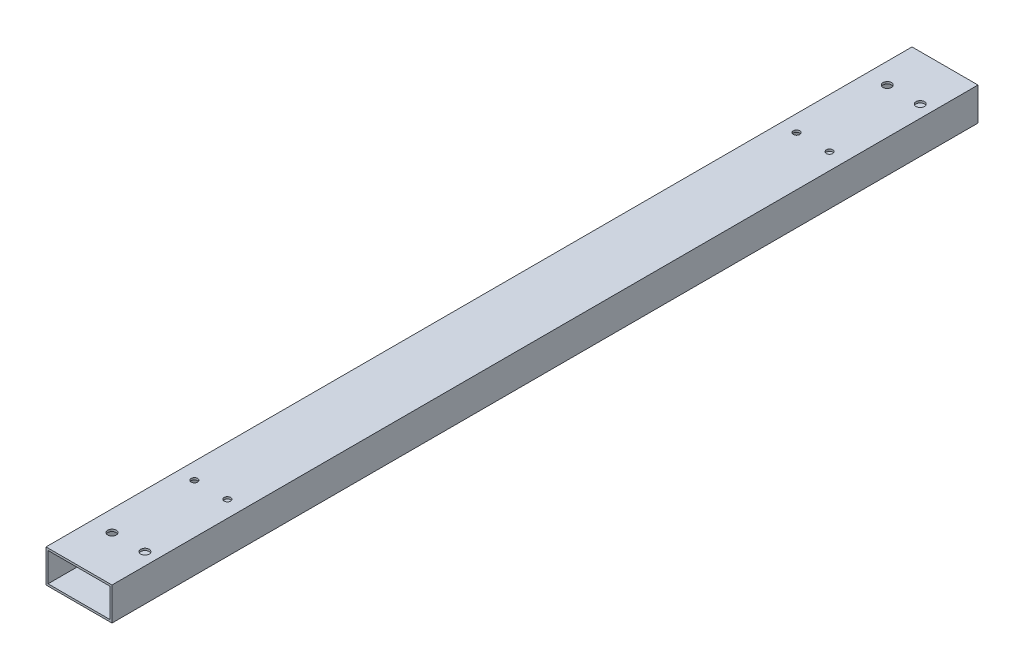
ISO-10303-21;
HEADER;
FILE_DESCRIPTION(('STEP AP214'),'2;1');
FILE_NAME('part.step','',(''),(''),'','','');
FILE_SCHEMA(('AUTOMOTIVE_DESIGN { 1 0 10303 214 1 1 1 1 }'));
ENDSEC;
DATA;
#1=APPLICATION_CONTEXT('core data for automotive mechanical design processes');
#2=APPLICATION_PROTOCOL_DEFINITION('international standard','automotive_design',2000,#1);
#3=PRODUCT_CONTEXT('',#1,'mechanical');
#4=PRODUCT('Part','Part','',(#3));
#5=PRODUCT_RELATED_PRODUCT_CATEGORY('part','',(#4));
#6=PRODUCT_DEFINITION_FORMATION('','',#4);
#7=PRODUCT_DEFINITION_CONTEXT('part definition',#1,'design');
#8=PRODUCT_DEFINITION('design','',#6,#7);
#9=PRODUCT_DEFINITION_SHAPE('','',#8);
#10=(LENGTH_UNIT() NAMED_UNIT(*) SI_UNIT(.MILLI.,.METRE.));
#11=(NAMED_UNIT(*) PLANE_ANGLE_UNIT() SI_UNIT($,.RADIAN.));
#12=(NAMED_UNIT(*) SI_UNIT($,.STERADIAN.) SOLID_ANGLE_UNIT());
#13=UNCERTAINTY_MEASURE_WITH_UNIT(LENGTH_MEASURE(1.E-05),#10,'distance_accuracy_value','');
#14=(GEOMETRIC_REPRESENTATION_CONTEXT(3) GLOBAL_UNCERTAINTY_ASSIGNED_CONTEXT((#13)) GLOBAL_UNIT_ASSIGNED_CONTEXT((#10,
#11,#12)) REPRESENTATION_CONTEXT('',''));
#15=CARTESIAN_POINT('',(0.,0.,0.));
#16=DIRECTION('',(0.,0.,1.));
#17=DIRECTION('',(1.,0.,0.));
#18=AXIS2_PLACEMENT_3D('',#15,#16,#17);
#19=CARTESIAN_POINT('',(38.1,13.3600000001,101.6));
#20=DIRECTION('',(0.,1.,0.));
#21=DIRECTION('',(0.,0.,1.));
#22=AXIS2_PLACEMENT_3D('',#19,#20,#21);
#23=CYLINDRICAL_SURFACE('',#22,4.7625);
#24=CARTESIAN_POINT('',(38.1,0.,101.6));
#25=DIRECTION('',(0.,1.,0.));
#26=DIRECTION('',(0.,0.,1.));
#27=AXIS2_PLACEMENT_3D('',#24,#25,#26);
#28=CIRCLE('',#27,4.7625);
#29=CARTESIAN_POINT('',(38.1,0.,106.3625));
#30=VERTEX_POINT('',#29);
#31=EDGE_CURVE('E20',#30,#30,#28,.T.);
#32=ORIENTED_EDGE('',*,*,#31,.F.);
#33=EDGE_LOOP('',(#32));
#34=FACE_BOUND('',#33,.T.);
#35=CARTESIAN_POINT('',(38.1,1.5875,101.6));
#36=DIRECTION('',(0.,1.,0.));
#37=DIRECTION('',(0.,0.,1.));
#38=AXIS2_PLACEMENT_3D('',#35,#36,#37);
#39=CIRCLE('',#38,4.7625);
#40=CARTESIAN_POINT('',(38.1,1.5875,106.3625));
#41=VERTEX_POINT('',#40);
#42=EDGE_CURVE('E121',#41,#41,#39,.T.);
#43=ORIENTED_EDGE('',*,*,#42,.T.);
#44=EDGE_LOOP('',(#43));
#45=FACE_BOUND('',#44,.T.);
#46=ADVANCED_FACE('F17',(#34,#45),#23,.F.);
#47=CARTESIAN_POINT('',(12.7,13.3600000001,101.6));
#48=DIRECTION('',(0.,1.,0.));
#49=DIRECTION('',(0.,0.,1.));
#50=AXIS2_PLACEMENT_3D('',#47,#48,#49);
#51=CYLINDRICAL_SURFACE('',#50,4.7625);
#52=CARTESIAN_POINT('',(12.7,0.,101.6));
#53=DIRECTION('',(0.,1.,0.));
#54=DIRECTION('',(0.,0.,1.));
#55=AXIS2_PLACEMENT_3D('',#52,#53,#54);
#56=CIRCLE('',#55,4.7625);
#57=CARTESIAN_POINT('',(12.7,0.,106.3625));
#58=VERTEX_POINT('',#57);
#59=EDGE_CURVE('E209',#58,#58,#56,.T.);
#60=ORIENTED_EDGE('',*,*,#59,.F.);
#61=EDGE_LOOP('',(#60));
#62=FACE_BOUND('',#61,.T.);
#63=CARTESIAN_POINT('',(12.7,1.5875,101.6));
#64=DIRECTION('',(0.,1.,0.));
#65=DIRECTION('',(0.,0.,1.));
#66=AXIS2_PLACEMENT_3D('',#63,#64,#65);
#67=CIRCLE('',#66,4.7625);
#68=CARTESIAN_POINT('',(12.7,1.5875,106.3625));
#69=VERTEX_POINT('',#68);
#70=EDGE_CURVE('E188',#69,#69,#67,.T.);
#71=ORIENTED_EDGE('',*,*,#70,.T.);
#72=EDGE_LOOP('',(#71));
#73=FACE_BOUND('',#72,.T.);
#74=ADVANCED_FACE('F221',(#62,#73),#51,.F.);
#75=CARTESIAN_POINT('',(38.1,13.3600000001,565.15));
#76=DIRECTION('',(0.,1.,0.));
#77=DIRECTION('',(0.,0.,1.));
#78=AXIS2_PLACEMENT_3D('',#75,#76,#77);
#79=CYLINDRICAL_SURFACE('',#78,4.7625);
#80=CARTESIAN_POINT('',(38.1,0.,565.15));
#81=DIRECTION('',(0.,1.,0.));
#82=DIRECTION('',(0.,0.,1.));
#83=AXIS2_PLACEMENT_3D('',#80,#81,#82);
#84=CIRCLE('',#83,4.7625);
#85=CARTESIAN_POINT('',(38.1,0.,569.9125));
#86=VERTEX_POINT('',#85);
#87=EDGE_CURVE('E207',#86,#86,#84,.T.);
#88=ORIENTED_EDGE('',*,*,#87,.F.);
#89=EDGE_LOOP('',(#88));
#90=FACE_BOUND('',#89,.T.);
#91=CARTESIAN_POINT('',(38.1,1.5875,565.15));
#92=DIRECTION('',(0.,1.,0.));
#93=DIRECTION('',(0.,0.,1.));
#94=AXIS2_PLACEMENT_3D('',#91,#92,#93);
#95=CIRCLE('',#94,4.7625);
#96=CARTESIAN_POINT('',(38.1,1.5875,569.9125));
#97=VERTEX_POINT('',#96);
#98=EDGE_CURVE('E185',#97,#97,#95,.T.);
#99=ORIENTED_EDGE('',*,*,#98,.T.);
#100=EDGE_LOOP('',(#99));
#101=FACE_BOUND('',#100,.T.);
#102=ADVANCED_FACE('F365',(#90,#101),#79,.F.);
#103=CARTESIAN_POINT('',(12.7,13.3600000001,565.15));
#104=DIRECTION('',(0.,1.,0.));
#105=DIRECTION('',(0.,0.,1.));
#106=AXIS2_PLACEMENT_3D('',#103,#104,#105);
#107=CYLINDRICAL_SURFACE('',#106,4.7625);
#108=CARTESIAN_POINT('',(12.7,0.,565.15));
#109=DIRECTION('',(0.,1.,0.));
#110=DIRECTION('',(0.,0.,1.));
#111=AXIS2_PLACEMENT_3D('',#108,#109,#110);
#112=CIRCLE('',#111,4.7625);
#113=CARTESIAN_POINT('',(12.7,0.,569.9125));
#114=VERTEX_POINT('',#113);
#115=EDGE_CURVE('E204',#114,#114,#112,.T.);
#116=ORIENTED_EDGE('',*,*,#115,.F.);
#117=EDGE_LOOP('',(#116));
#118=FACE_BOUND('',#117,.T.);
#119=CARTESIAN_POINT('',(12.7,1.5875,565.15));
#120=DIRECTION('',(0.,1.,0.));
#121=DIRECTION('',(0.,0.,1.));
#122=AXIS2_PLACEMENT_3D('',#119,#120,#121);
#123=CIRCLE('',#122,4.7625);
#124=CARTESIAN_POINT('',(12.7,1.5875,569.9125));
#125=VERTEX_POINT('',#124);
#126=EDGE_CURVE('E182',#125,#125,#123,.T.);
#127=ORIENTED_EDGE('',*,*,#126,.T.);
#128=EDGE_LOOP('',(#127));
#129=FACE_BOUND('',#128,.T.);
#130=ADVANCED_FACE('F361',(#118,#129),#107,.F.);
#131=CARTESIAN_POINT('',(15.875,13.3600000001,631.825));
#132=DIRECTION('',(0.,1.,0.));
#133=DIRECTION('',(0.,0.,1.));
#134=AXIS2_PLACEMENT_3D('',#131,#132,#133);
#135=CYLINDRICAL_SURFACE('',#134,3.2639);
#136=CARTESIAN_POINT('',(15.875,0.,631.825));
#137=DIRECTION('',(0.,1.,0.));
#138=DIRECTION('',(0.,0.,1.));
#139=AXIS2_PLACEMENT_3D('',#136,#137,#138);
#140=CIRCLE('',#139,3.2639);
#141=CARTESIAN_POINT('',(15.875,0.,635.0889));
#142=VERTEX_POINT('',#141);
#143=EDGE_CURVE('E201',#142,#142,#140,.T.);
#144=ORIENTED_EDGE('',*,*,#143,.F.);
#145=EDGE_LOOP('',(#144));
#146=FACE_BOUND('',#145,.T.);
#147=CARTESIAN_POINT('',(15.875,1.5875,631.825));
#148=DIRECTION('',(0.,1.,0.));
#149=DIRECTION('',(0.,0.,1.));
#150=AXIS2_PLACEMENT_3D('',#147,#148,#149);
#151=CIRCLE('',#150,3.2639);
#152=CARTESIAN_POINT('',(15.875,1.5875,635.0889));
#153=VERTEX_POINT('',#152);
#154=EDGE_CURVE('E179',#153,#153,#151,.T.);
#155=ORIENTED_EDGE('',*,*,#154,.T.);
#156=EDGE_LOOP('',(#155));
#157=FACE_BOUND('',#156,.T.);
#158=ADVANCED_FACE('F357',(#146,#157),#135,.F.);
#159=CARTESIAN_POINT('',(41.275,13.3600000001,631.825));
#160=DIRECTION('',(0.,1.,0.));
#161=DIRECTION('',(0.,0.,1.));
#162=AXIS2_PLACEMENT_3D('',#159,#160,#161);
#163=CYLINDRICAL_SURFACE('',#162,3.2639);
#164=CARTESIAN_POINT('',(41.275,0.,631.825));
#165=DIRECTION('',(0.,1.,0.));
#166=DIRECTION('',(0.,0.,1.));
#167=AXIS2_PLACEMENT_3D('',#164,#165,#166);
#168=CIRCLE('',#167,3.2639);
#169=CARTESIAN_POINT('',(41.275,0.,635.0889));
#170=VERTEX_POINT('',#169);
#171=EDGE_CURVE('E198',#170,#170,#168,.T.);
#172=ORIENTED_EDGE('',*,*,#171,.F.);
#173=EDGE_LOOP('',(#172));
#174=FACE_BOUND('',#173,.T.);
#175=CARTESIAN_POINT('',(41.275,1.5875,631.825));
#176=DIRECTION('',(0.,1.,0.));
#177=DIRECTION('',(0.,0.,1.));
#178=AXIS2_PLACEMENT_3D('',#175,#176,#177);
#179=CIRCLE('',#178,3.2639);
#180=CARTESIAN_POINT('',(41.275,1.5875,635.0889));
#181=VERTEX_POINT('',#180);
#182=EDGE_CURVE('E176',#181,#181,#179,.T.);
#183=ORIENTED_EDGE('',*,*,#182,.T.);
#184=EDGE_LOOP('',(#183));
#185=FACE_BOUND('',#184,.T.);
#186=ADVANCED_FACE('F353',(#174,#185),#163,.F.);
#187=CARTESIAN_POINT('',(41.275,13.3600000001,34.925));
#188=DIRECTION('',(0.,1.,0.));
#189=DIRECTION('',(0.,0.,1.));
#190=AXIS2_PLACEMENT_3D('',#187,#188,#189);
#191=CYLINDRICAL_SURFACE('',#190,3.2639);
#192=CARTESIAN_POINT('',(41.275,0.,34.925));
#193=DIRECTION('',(0.,1.,0.));
#194=DIRECTION('',(0.,0.,1.));
#195=AXIS2_PLACEMENT_3D('',#192,#193,#194);
#196=CIRCLE('',#195,3.2639);
#197=CARTESIAN_POINT('',(41.275,0.,38.1889));
#198=VERTEX_POINT('',#197);
#199=EDGE_CURVE('E195',#198,#198,#196,.T.);
#200=ORIENTED_EDGE('',*,*,#199,.F.);
#201=EDGE_LOOP('',(#200));
#202=FACE_BOUND('',#201,.T.);
#203=CARTESIAN_POINT('',(41.275,1.5875,34.925));
#204=DIRECTION('',(0.,1.,0.));
#205=DIRECTION('',(0.,0.,1.));
#206=AXIS2_PLACEMENT_3D('',#203,#204,#205);
#207=CIRCLE('',#206,3.2639);
#208=CARTESIAN_POINT('',(41.275,1.5875,38.1889));
#209=VERTEX_POINT('',#208);
#210=EDGE_CURVE('E173',#209,#209,#207,.T.);
#211=ORIENTED_EDGE('',*,*,#210,.T.);
#212=EDGE_LOOP('',(#211));
#213=FACE_BOUND('',#212,.T.);
#214=ADVANCED_FACE('F349',(#202,#213),#191,.F.);
#215=CARTESIAN_POINT('',(15.875,13.3600000001,34.925));
#216=DIRECTION('',(0.,1.,0.));
#217=DIRECTION('',(0.,0.,1.));
#218=AXIS2_PLACEMENT_3D('',#215,#216,#217);
#219=CYLINDRICAL_SURFACE('',#218,3.2639);
#220=CARTESIAN_POINT('',(15.875,0.,34.925));
#221=DIRECTION('',(0.,1.,0.));
#222=DIRECTION('',(0.,0.,1.));
#223=AXIS2_PLACEMENT_3D('',#220,#221,#222);
#224=CIRCLE('',#223,3.2639);
#225=CARTESIAN_POINT('',(15.875,0.,38.1889));
#226=VERTEX_POINT('',#225);
#227=EDGE_CURVE('E122',#226,#226,#224,.T.);
#228=ORIENTED_EDGE('',*,*,#227,.F.);
#229=EDGE_LOOP('',(#228));
#230=FACE_BOUND('',#229,.T.);
#231=CARTESIAN_POINT('',(15.875,1.5875,34.925));
#232=DIRECTION('',(0.,1.,0.));
#233=DIRECTION('',(0.,0.,1.));
#234=AXIS2_PLACEMENT_3D('',#231,#232,#233);
#235=CIRCLE('',#234,3.2639);
#236=CARTESIAN_POINT('',(15.875,1.5875,38.1889));
#237=VERTEX_POINT('',#236);
#238=EDGE_CURVE('E119',#237,#237,#235,.T.);
#239=ORIENTED_EDGE('',*,*,#238,.T.);
#240=EDGE_LOOP('',(#239));
#241=FACE_BOUND('',#240,.T.);
#242=ADVANCED_FACE('F345',(#230,#241),#219,.F.);
#243=CARTESIAN_POINT('',(0.,0.,0.));
#244=DIRECTION('',(0.,-1.,0.));
#245=DIRECTION('',(0.,0.,-1.));
#246=AXIS2_PLACEMENT_3D('',#243,#244,#245);
#247=PLANE('',#246);
#248=ORIENTED_EDGE('',*,*,#227,.T.);
#249=EDGE_LOOP('',(#248));
#250=FACE_BOUND('',#249,.T.);
#251=ORIENTED_EDGE('',*,*,#199,.T.);
#252=EDGE_LOOP('',(#251));
#253=FACE_BOUND('',#252,.T.);
#254=ORIENTED_EDGE('',*,*,#171,.T.);
#255=EDGE_LOOP('',(#254));
#256=FACE_BOUND('',#255,.T.);
#257=ORIENTED_EDGE('',*,*,#143,.T.);
#258=EDGE_LOOP('',(#257));
#259=FACE_BOUND('',#258,.T.);
#260=ORIENTED_EDGE('',*,*,#115,.T.);
#261=EDGE_LOOP('',(#260));
#262=FACE_BOUND('',#261,.T.);
#263=ORIENTED_EDGE('',*,*,#87,.T.);
#264=EDGE_LOOP('',(#263));
#265=FACE_BOUND('',#264,.T.);
#266=ORIENTED_EDGE('',*,*,#59,.T.);
#267=EDGE_LOOP('',(#266));
#268=FACE_BOUND('',#267,.T.);
#269=ORIENTED_EDGE('',*,*,#31,.T.);
#270=EDGE_LOOP('',(#269));
#271=FACE_BOUND('',#270,.T.);
#272=DIRECTION('',(0.,0.,-1.));
#273=VECTOR('',#272,1.);
#274=CARTESIAN_POINT('',(50.8,0.,0.));
#275=LINE('',#274,#273);
#276=CARTESIAN_POINT('',(50.8,0.,666.75));
#277=VERTEX_POINT('',#276);
#278=CARTESIAN_POINT('',(50.8,0.,0.));
#279=VERTEX_POINT('',#278);
#280=EDGE_CURVE('E114',#277,#279,#275,.T.);
#281=ORIENTED_EDGE('',*,*,#280,.F.);
#282=DIRECTION('',(1.,0.,0.));
#283=VECTOR('',#282,1.);
#284=CARTESIAN_POINT('',(0.,0.,666.75));
#285=LINE('',#284,#283);
#286=CARTESIAN_POINT('',(0.,0.,666.75));
#287=VERTEX_POINT('',#286);
#288=EDGE_CURVE('E249',#287,#277,#285,.T.);
#289=ORIENTED_EDGE('',*,*,#288,.F.);
#290=DIRECTION('',(0.,0.,1.));
#291=VECTOR('',#290,1.);
#292=CARTESIAN_POINT('',(0.,0.,0.));
#293=LINE('',#292,#291);
#294=CARTESIAN_POINT('',(0.,0.,0.));
#295=VERTEX_POINT('',#294);
#296=EDGE_CURVE('E252',#295,#287,#293,.T.);
#297=ORIENTED_EDGE('',*,*,#296,.F.);
#298=DIRECTION('',(1.,0.,0.));
#299=VECTOR('',#298,1.);
#300=CARTESIAN_POINT('',(0.,0.,0.));
#301=LINE('',#300,#299);
#302=EDGE_CURVE('E111',#295,#279,#301,.T.);
#303=ORIENTED_EDGE('',*,*,#302,.T.);
#304=EDGE_LOOP('',(#281,#289,#297,#303));
#305=FACE_BOUND('',#304,.T.);
#306=ADVANCED_FACE('F216',(#250,#253,#256,#259,#262,#265,#268,#271,#305),#247,.T.);
#307=CARTESIAN_POINT('',(49.2125,1.5875,0.));
#308=DIRECTION('',(1.,0.,0.));
#309=DIRECTION('',(0.,0.,-1.));
#310=AXIS2_PLACEMENT_3D('',#307,#308,#309);
#311=PLANE('',#310);
#312=DIRECTION('',(0.,0.,1.));
#313=VECTOR('',#312,1.);
#314=CARTESIAN_POINT('',(49.2125,23.8125,0.));
#315=LINE('',#314,#313);
#316=CARTESIAN_POINT('',(49.2125,23.8125,666.75));
#317=VERTEX_POINT('',#316);
#318=CARTESIAN_POINT('',(49.2125,23.8125,0.));
#319=VERTEX_POINT('',#318);
#320=EDGE_CURVE('E79',#317,#319,#315,.F.);
#321=ORIENTED_EDGE('',*,*,#320,.T.);
#322=DIRECTION('',(0.,1.,0.));
#323=VECTOR('',#322,1.);
#324=CARTESIAN_POINT('',(49.2125,0.,0.));
#325=LINE('',#324,#323);
#326=CARTESIAN_POINT('',(49.2125,1.5875,0.));
#327=VERTEX_POINT('',#326);
#328=EDGE_CURVE('E83',#319,#327,#325,.F.);
#329=ORIENTED_EDGE('',*,*,#328,.T.);
#330=DIRECTION('',(0.,0.,-1.));
#331=VECTOR('',#330,1.);
#332=CARTESIAN_POINT('',(49.2125,1.5875,0.));
#333=LINE('',#332,#331);
#334=CARTESIAN_POINT('',(49.2125,1.5875,666.75));
#335=VERTEX_POINT('',#334);
#336=EDGE_CURVE('E120',#327,#335,#333,.F.);
#337=ORIENTED_EDGE('',*,*,#336,.T.);
#338=DIRECTION('',(0.,1.,0.));
#339=VECTOR('',#338,1.);
#340=CARTESIAN_POINT('',(49.2125,0.,666.75));
#341=LINE('',#340,#339);
#342=EDGE_CURVE('E86',#317,#335,#341,.F.);
#343=ORIENTED_EDGE('',*,*,#342,.F.);
#344=EDGE_LOOP('',(#321,#329,#337,#343));
#345=FACE_BOUND('',#344,.T.);
#346=ADVANCED_FACE('F81',(#345),#311,.F.);
#347=CARTESIAN_POINT('',(1.5875,1.5875,0.));
#348=DIRECTION('',(0.,-1.,0.));
#349=DIRECTION('',(0.,0.,-1.));
#350=AXIS2_PLACEMENT_3D('',#347,#348,#349);
#351=PLANE('',#350);
#352=ORIENTED_EDGE('',*,*,#238,.F.);
#353=EDGE_LOOP('',(#352));
#354=FACE_BOUND('',#353,.T.);
#355=ORIENTED_EDGE('',*,*,#210,.F.);
#356=EDGE_LOOP('',(#355));
#357=FACE_BOUND('',#356,.T.);
#358=ORIENTED_EDGE('',*,*,#182,.F.);
#359=EDGE_LOOP('',(#358));
#360=FACE_BOUND('',#359,.T.);
#361=ORIENTED_EDGE('',*,*,#154,.F.);
#362=EDGE_LOOP('',(#361));
#363=FACE_BOUND('',#362,.T.);
#364=ORIENTED_EDGE('',*,*,#126,.F.);
#365=EDGE_LOOP('',(#364));
#366=FACE_BOUND('',#365,.T.);
#367=ORIENTED_EDGE('',*,*,#98,.F.);
#368=EDGE_LOOP('',(#367));
#369=FACE_BOUND('',#368,.T.);
#370=ORIENTED_EDGE('',*,*,#70,.F.);
#371=EDGE_LOOP('',(#370));
#372=FACE_BOUND('',#371,.T.);
#373=ORIENTED_EDGE('',*,*,#42,.F.);
#374=EDGE_LOOP('',(#373));
#375=FACE_BOUND('',#374,.T.);
#376=ORIENTED_EDGE('',*,*,#336,.F.);
#377=DIRECTION('',(1.,0.,0.));
#378=VECTOR('',#377,1.);
#379=CARTESIAN_POINT('',(0.,1.5875,0.));
#380=LINE('',#379,#378);
#381=CARTESIAN_POINT('',(1.5875,1.5875,0.));
#382=VERTEX_POINT('',#381);
#383=EDGE_CURVE('E104',#327,#382,#380,.F.);
#384=ORIENTED_EDGE('',*,*,#383,.T.);
#385=DIRECTION('',(0.,0.,1.));
#386=VECTOR('',#385,1.);
#387=CARTESIAN_POINT('',(1.5875,1.5875,0.));
#388=LINE('',#387,#386);
#389=CARTESIAN_POINT('',(1.5875,1.5875,666.75));
#390=VERTEX_POINT('',#389);
#391=EDGE_CURVE('E91',#382,#390,#388,.T.);
#392=ORIENTED_EDGE('',*,*,#391,.T.);
#393=DIRECTION('',(1.,0.,0.));
#394=VECTOR('',#393,1.);
#395=CARTESIAN_POINT('',(0.,1.5875,666.75));
#396=LINE('',#395,#394);
#397=EDGE_CURVE('E233',#335,#390,#396,.F.);
#398=ORIENTED_EDGE('',*,*,#397,.F.);
#399=EDGE_LOOP('',(#376,#384,#392,#398));
#400=FACE_BOUND('',#399,.T.);
#401=ADVANCED_FACE('F224',(#354,#357,#360,#363,#366,#369,#372,#375,#400),#351,.F.);
#402=CARTESIAN_POINT('',(1.5875,23.8125,0.));
#403=DIRECTION('',(-1.,0.,0.));
#404=DIRECTION('',(0.,0.,1.));
#405=AXIS2_PLACEMENT_3D('',#402,#403,#404);
#406=PLANE('',#405);
#407=ORIENTED_EDGE('',*,*,#391,.F.);
#408=DIRECTION('',(0.,1.,0.));
#409=VECTOR('',#408,1.);
#410=CARTESIAN_POINT('',(1.5875,0.,0.));
#411=LINE('',#410,#409);
#412=CARTESIAN_POINT('',(1.5875,23.8125,0.));
#413=VERTEX_POINT('',#412);
#414=EDGE_CURVE('E106',#382,#413,#411,.T.);
#415=ORIENTED_EDGE('',*,*,#414,.T.);
#416=DIRECTION('',(0.,0.,1.));
#417=VECTOR('',#416,1.);
#418=CARTESIAN_POINT('',(1.5875,23.8125,0.));
#419=LINE('',#418,#417);
#420=CARTESIAN_POINT('',(1.5875,23.8125,666.75));
#421=VERTEX_POINT('',#420);
#422=EDGE_CURVE('E90',#413,#421,#419,.T.);
#423=ORIENTED_EDGE('',*,*,#422,.T.);
#424=DIRECTION('',(0.,1.,0.));
#425=VECTOR('',#424,1.);
#426=CARTESIAN_POINT('',(1.5875,0.,666.75));
#427=LINE('',#426,#425);
#428=EDGE_CURVE('E170',#390,#421,#427,.T.);
#429=ORIENTED_EDGE('',*,*,#428,.F.);
#430=EDGE_LOOP('',(#407,#415,#423,#429));
#431=FACE_BOUND('',#430,.T.);
#432=ADVANCED_FACE('F227',(#431),#406,.F.);
#433=CARTESIAN_POINT('',(49.2125,23.8125,0.));
#434=DIRECTION('',(0.,1.,0.));
#435=DIRECTION('',(0.,0.,1.));
#436=AXIS2_PLACEMENT_3D('',#433,#434,#435);
#437=PLANE('',#436);
#438=CARTESIAN_POINT('',(15.875,23.8125,34.925));
#439=DIRECTION('',(0.,1.,0.));
#440=DIRECTION('',(0.,0.,1.));
#441=AXIS2_PLACEMENT_3D('',#438,#439,#440);
#442=CIRCLE('',#441,3.2639);
#443=CARTESIAN_POINT('',(15.875,23.8125,38.1889));
#444=VERTEX_POINT('',#443);
#445=EDGE_CURVE('E145',#444,#444,#442,.T.);
#446=ORIENTED_EDGE('',*,*,#445,.T.);
#447=EDGE_LOOP('',(#446));
#448=FACE_BOUND('',#447,.T.);
#449=CARTESIAN_POINT('',(41.275,23.8125,34.925));
#450=DIRECTION('',(0.,1.,0.));
#451=DIRECTION('',(0.,0.,1.));
#452=AXIS2_PLACEMENT_3D('',#449,#450,#451);
#453=CIRCLE('',#452,3.2639);
#454=CARTESIAN_POINT('',(41.275,23.8125,38.1889));
#455=VERTEX_POINT('',#454);
#456=EDGE_CURVE('E149',#455,#455,#453,.T.);
#457=ORIENTED_EDGE('',*,*,#456,.T.);
#458=EDGE_LOOP('',(#457));
#459=FACE_BOUND('',#458,.T.);
#460=CARTESIAN_POINT('',(41.275,23.8125,631.825));
#461=DIRECTION('',(0.,1.,0.));
#462=DIRECTION('',(0.,0.,1.));
#463=AXIS2_PLACEMENT_3D('',#460,#461,#462);
#464=CIRCLE('',#463,3.2639);
#465=CARTESIAN_POINT('',(41.275,23.8125,635.0889));
#466=VERTEX_POINT('',#465);
#467=EDGE_CURVE('E152',#466,#466,#464,.T.);
#468=ORIENTED_EDGE('',*,*,#467,.T.);
#469=EDGE_LOOP('',(#468));
#470=FACE_BOUND('',#469,.T.);
#471=CARTESIAN_POINT('',(15.875,23.8125,631.825));
#472=DIRECTION('',(0.,1.,0.));
#473=DIRECTION('',(0.,0.,1.));
#474=AXIS2_PLACEMENT_3D('',#471,#472,#473);
#475=CIRCLE('',#474,3.2639);
#476=CARTESIAN_POINT('',(15.875,23.8125,635.0889));
#477=VERTEX_POINT('',#476);
#478=EDGE_CURVE('E155',#477,#477,#475,.T.);
#479=ORIENTED_EDGE('',*,*,#478,.T.);
#480=EDGE_LOOP('',(#479));
#481=FACE_BOUND('',#480,.T.);
#482=CARTESIAN_POINT('',(12.7,23.8125,565.15));
#483=DIRECTION('',(0.,-1.,0.));
#484=DIRECTION('',(0.,0.,-1.));
#485=AXIS2_PLACEMENT_3D('',#482,#483,#484);
#486=CIRCLE('',#485,2.4892);
#487=CARTESIAN_POINT('',(12.7,23.8125,562.6608));
#488=VERTEX_POINT('',#487);
#489=EDGE_CURVE('E158',#488,#488,#486,.F.);
#490=ORIENTED_EDGE('',*,*,#489,.T.);
#491=EDGE_LOOP('',(#490));
#492=FACE_BOUND('',#491,.T.);
#493=CARTESIAN_POINT('',(38.1,23.8125,565.15));
#494=DIRECTION('',(0.,-1.,0.));
#495=DIRECTION('',(0.,0.,-1.));
#496=AXIS2_PLACEMENT_3D('',#493,#494,#495);
#497=CIRCLE('',#496,2.4892);
#498=CARTESIAN_POINT('',(38.1,23.8125,562.6608));
#499=VERTEX_POINT('',#498);
#500=EDGE_CURVE('E161',#499,#499,#497,.F.);
#501=ORIENTED_EDGE('',*,*,#500,.T.);
#502=EDGE_LOOP('',(#501));
#503=FACE_BOUND('',#502,.T.);
#504=CARTESIAN_POINT('',(12.7,23.8125,101.6));
#505=DIRECTION('',(0.,-1.,0.));
#506=DIRECTION('',(0.,0.,-1.));
#507=AXIS2_PLACEMENT_3D('',#504,#505,#506);
#508=CIRCLE('',#507,2.4892);
#509=CARTESIAN_POINT('',(12.7,23.8125,99.1108));
#510=VERTEX_POINT('',#509);
#511=EDGE_CURVE('E164',#510,#510,#508,.F.);
#512=ORIENTED_EDGE('',*,*,#511,.T.);
#513=EDGE_LOOP('',(#512));
#514=FACE_BOUND('',#513,.T.);
#515=CARTESIAN_POINT('',(38.1,23.8125,101.6));
#516=DIRECTION('',(0.,-1.,0.));
#517=DIRECTION('',(0.,0.,-1.));
#518=AXIS2_PLACEMENT_3D('',#515,#516,#517);
#519=CIRCLE('',#518,2.4892);
#520=CARTESIAN_POINT('',(38.1,23.8125,99.1108));
#521=VERTEX_POINT('',#520);
#522=EDGE_CURVE('E167',#521,#521,#519,.F.);
#523=ORIENTED_EDGE('',*,*,#522,.T.);
#524=EDGE_LOOP('',(#523));
#525=FACE_BOUND('',#524,.T.);
#526=ORIENTED_EDGE('',*,*,#422,.F.);
#527=DIRECTION('',(1.,0.,0.));
#528=VECTOR('',#527,1.);
#529=CARTESIAN_POINT('',(0.,23.8125,0.));
#530=LINE('',#529,#528);
#531=EDGE_CURVE('E94',#413,#319,#530,.T.);
#532=ORIENTED_EDGE('',*,*,#531,.T.);
#533=ORIENTED_EDGE('',*,*,#320,.F.);
#534=DIRECTION('',(1.,0.,0.));
#535=VECTOR('',#534,1.);
#536=CARTESIAN_POINT('',(0.,23.8125,666.75));
#537=LINE('',#536,#535);
#538=EDGE_CURVE('E240',#421,#317,#537,.T.);
#539=ORIENTED_EDGE('',*,*,#538,.F.);
#540=EDGE_LOOP('',(#526,#532,#533,#539));
#541=FACE_BOUND('',#540,.T.);
#542=ADVANCED_FACE('F95',(#448,#459,#470,#481,#492,#503,#514,#525,#541),#437,.F.);
#543=CARTESIAN_POINT('',(50.8,0.,0.));
#544=DIRECTION('',(1.,0.,0.));
#545=DIRECTION('',(0.,0.,-1.));
#546=AXIS2_PLACEMENT_3D('',#543,#544,#545);
#547=PLANE('',#546);
#548=DIRECTION('',(0.,0.,1.));
#549=VECTOR('',#548,1.);
#550=CARTESIAN_POINT('',(50.8,25.4,0.));
#551=LINE('',#550,#549);
#552=CARTESIAN_POINT('',(50.8,25.4,666.75));
#553=VERTEX_POINT('',#552);
#554=CARTESIAN_POINT('',(50.8,25.4,0.));
#555=VERTEX_POINT('',#554);
#556=EDGE_CURVE('E148',#553,#555,#551,.F.);
#557=ORIENTED_EDGE('',*,*,#556,.F.);
#558=DIRECTION('',(0.,1.,0.));
#559=VECTOR('',#558,1.);
#560=CARTESIAN_POINT('',(50.8,0.,666.75));
#561=LINE('',#560,#559);
#562=EDGE_CURVE('E246',#277,#553,#561,.T.);
#563=ORIENTED_EDGE('',*,*,#562,.F.);
#564=ORIENTED_EDGE('',*,*,#280,.T.);
#565=DIRECTION('',(0.,1.,0.));
#566=VECTOR('',#565,1.);
#567=CARTESIAN_POINT('',(50.8,0.,0.));
#568=LINE('',#567,#566);
#569=EDGE_CURVE('E99',#279,#555,#568,.T.);
#570=ORIENTED_EDGE('',*,*,#569,.T.);
#571=EDGE_LOOP('',(#557,#563,#564,#570));
#572=FACE_BOUND('',#571,.T.);
#573=ADVANCED_FACE('F271',(#572),#547,.T.);
#574=CARTESIAN_POINT('',(0.,0.,0.));
#575=DIRECTION('',(0.,0.,1.));
#576=DIRECTION('',(1.,0.,0.));
#577=AXIS2_PLACEMENT_3D('',#574,#575,#576);
#578=PLANE('',#577);
#579=ORIENTED_EDGE('',*,*,#383,.F.);
#580=ORIENTED_EDGE('',*,*,#328,.F.);
#581=ORIENTED_EDGE('',*,*,#531,.F.);
#582=ORIENTED_EDGE('',*,*,#414,.F.);
#583=EDGE_LOOP('',(#579,#580,#581,#582));
#584=FACE_BOUND('',#583,.T.);
#585=DIRECTION('',(1.,0.,0.));
#586=VECTOR('',#585,1.);
#587=CARTESIAN_POINT('',(50.8,25.4,0.));
#588=LINE('',#587,#586);
#589=CARTESIAN_POINT('',(0.,25.4,0.));
#590=VERTEX_POINT('',#589);
#591=EDGE_CURVE('E260',#555,#590,#588,.F.);
#592=ORIENTED_EDGE('',*,*,#591,.F.);
#593=ORIENTED_EDGE('',*,*,#569,.F.);
#594=ORIENTED_EDGE('',*,*,#302,.F.);
#595=DIRECTION('',(0.,1.,0.));
#596=VECTOR('',#595,1.);
#597=CARTESIAN_POINT('',(0.,25.4,0.));
#598=LINE('',#597,#596);
#599=EDGE_CURVE('E254',#590,#295,#598,.F.);
#600=ORIENTED_EDGE('',*,*,#599,.F.);
#601=EDGE_LOOP('',(#592,#593,#594,#600));
#602=FACE_BOUND('',#601,.T.);
#603=ADVANCED_FACE('F102',(#584,#602),#578,.F.);
#604=CARTESIAN_POINT('',(0.,25.4,0.));
#605=DIRECTION('',(-1.,0.,0.));
#606=DIRECTION('',(0.,0.,1.));
#607=AXIS2_PLACEMENT_3D('',#604,#605,#606);
#608=PLANE('',#607);
#609=ORIENTED_EDGE('',*,*,#296,.T.);
#610=DIRECTION('',(0.,1.,0.));
#611=VECTOR('',#610,1.);
#612=CARTESIAN_POINT('',(0.,0.,666.75));
#613=LINE('',#612,#611);
#614=CARTESIAN_POINT('',(0.,25.4,666.75));
#615=VERTEX_POINT('',#614);
#616=EDGE_CURVE('E35',#615,#287,#613,.F.);
#617=ORIENTED_EDGE('',*,*,#616,.F.);
#618=DIRECTION('',(0.,0.,1.));
#619=VECTOR('',#618,1.);
#620=CARTESIAN_POINT('',(0.,25.4,0.));
#621=LINE('',#620,#619);
#622=EDGE_CURVE('E263',#590,#615,#621,.T.);
#623=ORIENTED_EDGE('',*,*,#622,.F.);
#624=ORIENTED_EDGE('',*,*,#599,.T.);
#625=EDGE_LOOP('',(#609,#617,#623,#624));
#626=FACE_BOUND('',#625,.T.);
#627=ADVANCED_FACE('F275',(#626),#608,.T.);
#628=CARTESIAN_POINT('',(0.,0.,666.75));
#629=DIRECTION('',(0.,0.,1.));
#630=DIRECTION('',(1.,0.,0.));
#631=AXIS2_PLACEMENT_3D('',#628,#629,#630);
#632=PLANE('',#631);
#633=ORIENTED_EDGE('',*,*,#397,.T.);
#634=ORIENTED_EDGE('',*,*,#428,.T.);
#635=ORIENTED_EDGE('',*,*,#538,.T.);
#636=ORIENTED_EDGE('',*,*,#342,.T.);
#637=EDGE_LOOP('',(#633,#634,#635,#636));
#638=FACE_BOUND('',#637,.T.);
#639=DIRECTION('',(1.,0.,0.));
#640=VECTOR('',#639,1.);
#641=CARTESIAN_POINT('',(50.8,25.4,666.75));
#642=LINE('',#641,#640);
#643=EDGE_CURVE('E144',#615,#553,#642,.T.);
#644=ORIENTED_EDGE('',*,*,#643,.F.);
#645=ORIENTED_EDGE('',*,*,#616,.T.);
#646=ORIENTED_EDGE('',*,*,#288,.T.);
#647=ORIENTED_EDGE('',*,*,#562,.T.);
#648=EDGE_LOOP('',(#644,#645,#646,#647));
#649=FACE_BOUND('',#648,.T.);
#650=ADVANCED_FACE('F238',(#638,#649),#632,.T.);
#651=CARTESIAN_POINT('',(38.1,25.2662500004,101.6));
#652=DIRECTION('',(0.,-1.,0.));
#653=DIRECTION('',(0.,0.,-1.));
#654=AXIS2_PLACEMENT_3D('',#651,#652,#653);
#655=CYLINDRICAL_SURFACE('',#654,2.4892);
#656=ORIENTED_EDGE('',*,*,#522,.F.);
#657=EDGE_LOOP('',(#656));
#658=FACE_BOUND('',#657,.T.);
#659=CARTESIAN_POINT('',(38.1,25.4,101.6));
#660=DIRECTION('',(0.,-1.,0.));
#661=DIRECTION('',(0.,0.,-1.));
#662=AXIS2_PLACEMENT_3D('',#659,#660,#661);
#663=CIRCLE('',#662,2.4892);
#664=CARTESIAN_POINT('',(38.1,25.4,99.1108));
#665=VERTEX_POINT('',#664);
#666=EDGE_CURVE('E141',#665,#665,#663,.T.);
#667=ORIENTED_EDGE('',*,*,#666,.F.);
#668=EDGE_LOOP('',(#667));
#669=FACE_BOUND('',#668,.T.);
#670=ADVANCED_FACE('F283',(#658,#669),#655,.F.);
#671=CARTESIAN_POINT('',(12.7,25.2662500004,101.6));
#672=DIRECTION('',(0.,-1.,0.));
#673=DIRECTION('',(0.,0.,-1.));
#674=AXIS2_PLACEMENT_3D('',#671,#672,#673);
#675=CYLINDRICAL_SURFACE('',#674,2.4892);
#676=ORIENTED_EDGE('',*,*,#511,.F.);
#677=EDGE_LOOP('',(#676));
#678=FACE_BOUND('',#677,.T.);
#679=CARTESIAN_POINT('',(12.7,25.4,101.6));
#680=DIRECTION('',(0.,-1.,0.));
#681=DIRECTION('',(0.,0.,-1.));
#682=AXIS2_PLACEMENT_3D('',#679,#680,#681);
#683=CIRCLE('',#682,2.4892);
#684=CARTESIAN_POINT('',(12.7,25.4,99.1108));
#685=VERTEX_POINT('',#684);
#686=EDGE_CURVE('E138',#685,#685,#683,.T.);
#687=ORIENTED_EDGE('',*,*,#686,.F.);
#688=EDGE_LOOP('',(#687));
#689=FACE_BOUND('',#688,.T.);
#690=ADVANCED_FACE('F316',(#678,#689),#675,.F.);
#691=CARTESIAN_POINT('',(38.1,25.2662500004,565.15));
#692=DIRECTION('',(0.,-1.,0.));
#693=DIRECTION('',(0.,0.,-1.));
#694=AXIS2_PLACEMENT_3D('',#691,#692,#693);
#695=CYLINDRICAL_SURFACE('',#694,2.4892);
#696=ORIENTED_EDGE('',*,*,#500,.F.);
#697=EDGE_LOOP('',(#696));
#698=FACE_BOUND('',#697,.T.);
#699=CARTESIAN_POINT('',(38.1,25.4,565.15));
#700=DIRECTION('',(0.,-1.,0.));
#701=DIRECTION('',(0.,0.,-1.));
#702=AXIS2_PLACEMENT_3D('',#699,#700,#701);
#703=CIRCLE('',#702,2.4892);
#704=CARTESIAN_POINT('',(38.1,25.4,562.6608));
#705=VERTEX_POINT('',#704);
#706=EDGE_CURVE('E135',#705,#705,#703,.T.);
#707=ORIENTED_EDGE('',*,*,#706,.F.);
#708=EDGE_LOOP('',(#707));
#709=FACE_BOUND('',#708,.T.);
#710=ADVANCED_FACE('F312',(#698,#709),#695,.F.);
#711=CARTESIAN_POINT('',(12.7,25.2662500004,565.15));
#712=DIRECTION('',(0.,-1.,0.));
#713=DIRECTION('',(0.,0.,-1.));
#714=AXIS2_PLACEMENT_3D('',#711,#712,#713);
#715=CYLINDRICAL_SURFACE('',#714,2.4892);
#716=ORIENTED_EDGE('',*,*,#489,.F.);
#717=EDGE_LOOP('',(#716));
#718=FACE_BOUND('',#717,.T.);
#719=CARTESIAN_POINT('',(12.7,25.4,565.15));
#720=DIRECTION('',(0.,-1.,0.));
#721=DIRECTION('',(0.,0.,-1.));
#722=AXIS2_PLACEMENT_3D('',#719,#720,#721);
#723=CIRCLE('',#722,2.4892);
#724=CARTESIAN_POINT('',(12.7,25.4,562.6608));
#725=VERTEX_POINT('',#724);
#726=EDGE_CURVE('E132',#725,#725,#723,.T.);
#727=ORIENTED_EDGE('',*,*,#726,.F.);
#728=EDGE_LOOP('',(#727));
#729=FACE_BOUND('',#728,.T.);
#730=ADVANCED_FACE('F308',(#718,#729),#715,.F.);
#731=CARTESIAN_POINT('',(15.875,13.3600000001,631.825));
#732=DIRECTION('',(0.,1.,0.));
#733=DIRECTION('',(0.,0.,1.));
#734=AXIS2_PLACEMENT_3D('',#731,#732,#733);
#735=CYLINDRICAL_SURFACE('',#734,3.2639);
#736=CARTESIAN_POINT('',(15.875,25.4,631.825));
#737=DIRECTION('',(0.,1.,0.));
#738=DIRECTION('',(0.,0.,1.));
#739=AXIS2_PLACEMENT_3D('',#736,#737,#738);
#740=CIRCLE('',#739,3.2639);
#741=CARTESIAN_POINT('',(15.875,25.4,635.0889));
#742=VERTEX_POINT('',#741);
#743=EDGE_CURVE('E129',#742,#742,#740,.F.);
#744=ORIENTED_EDGE('',*,*,#743,.F.);
#745=EDGE_LOOP('',(#744));
#746=FACE_BOUND('',#745,.T.);
#747=ORIENTED_EDGE('',*,*,#478,.F.);
#748=EDGE_LOOP('',(#747));
#749=FACE_BOUND('',#748,.T.);
#750=ADVANCED_FACE('F304',(#746,#749),#735,.F.);
#751=CARTESIAN_POINT('',(41.275,13.3600000001,631.825));
#752=DIRECTION('',(0.,1.,0.));
#753=DIRECTION('',(0.,0.,1.));
#754=AXIS2_PLACEMENT_3D('',#751,#752,#753);
#755=CYLINDRICAL_SURFACE('',#754,3.2639);
#756=CARTESIAN_POINT('',(41.275,25.4,631.825));
#757=DIRECTION('',(0.,1.,0.));
#758=DIRECTION('',(0.,0.,1.));
#759=AXIS2_PLACEMENT_3D('',#756,#757,#758);
#760=CIRCLE('',#759,3.2639);
#761=CARTESIAN_POINT('',(41.275,25.4,635.0889));
#762=VERTEX_POINT('',#761);
#763=EDGE_CURVE('E126',#762,#762,#760,.F.);
#764=ORIENTED_EDGE('',*,*,#763,.F.);
#765=EDGE_LOOP('',(#764));
#766=FACE_BOUND('',#765,.T.);
#767=ORIENTED_EDGE('',*,*,#467,.F.);
#768=EDGE_LOOP('',(#767));
#769=FACE_BOUND('',#768,.T.);
#770=ADVANCED_FACE('F300',(#766,#769),#755,.F.);
#771=CARTESIAN_POINT('',(41.275,13.3600000001,34.925));
#772=DIRECTION('',(0.,1.,0.));
#773=DIRECTION('',(0.,0.,1.));
#774=AXIS2_PLACEMENT_3D('',#771,#772,#773);
#775=CYLINDRICAL_SURFACE('',#774,3.2639);
#776=CARTESIAN_POINT('',(41.275,25.4,34.925));
#777=DIRECTION('',(0.,1.,0.));
#778=DIRECTION('',(0.,0.,1.));
#779=AXIS2_PLACEMENT_3D('',#776,#777,#778);
#780=CIRCLE('',#779,3.2639);
#781=CARTESIAN_POINT('',(41.275,25.4,38.1889));
#782=VERTEX_POINT('',#781);
#783=EDGE_CURVE('E26',#782,#782,#780,.F.);
#784=ORIENTED_EDGE('',*,*,#783,.F.);
#785=EDGE_LOOP('',(#784));
#786=FACE_BOUND('',#785,.T.);
#787=ORIENTED_EDGE('',*,*,#456,.F.);
#788=EDGE_LOOP('',(#787));
#789=FACE_BOUND('',#788,.T.);
#790=ADVANCED_FACE('F293',(#786,#789),#775,.F.);
#791=CARTESIAN_POINT('',(15.875,13.3600000001,34.925));
#792=DIRECTION('',(0.,1.,0.));
#793=DIRECTION('',(0.,0.,1.));
#794=AXIS2_PLACEMENT_3D('',#791,#792,#793);
#795=CYLINDRICAL_SURFACE('',#794,3.2639);
#796=CARTESIAN_POINT('',(15.875,25.4,34.925));
#797=DIRECTION('',(0.,1.,0.));
#798=DIRECTION('',(0.,0.,1.));
#799=AXIS2_PLACEMENT_3D('',#796,#797,#798);
#800=CIRCLE('',#799,3.2639);
#801=CARTESIAN_POINT('',(15.875,25.4,38.1889));
#802=VERTEX_POINT('',#801);
#803=EDGE_CURVE('E11',#802,#802,#800,.F.);
#804=ORIENTED_EDGE('',*,*,#803,.F.);
#805=EDGE_LOOP('',(#804));
#806=FACE_BOUND('',#805,.T.);
#807=ORIENTED_EDGE('',*,*,#445,.F.);
#808=EDGE_LOOP('',(#807));
#809=FACE_BOUND('',#808,.T.);
#810=ADVANCED_FACE('F287',(#806,#809),#795,.F.);
#811=CARTESIAN_POINT('',(50.8,25.4,0.));
#812=DIRECTION('',(0.,1.,0.));
#813=DIRECTION('',(0.,0.,1.));
#814=AXIS2_PLACEMENT_3D('',#811,#812,#813);
#815=PLANE('',#814);
#816=ORIENTED_EDGE('',*,*,#803,.T.);
#817=EDGE_LOOP('',(#816));
#818=FACE_BOUND('',#817,.T.);
#819=ORIENTED_EDGE('',*,*,#783,.T.);
#820=EDGE_LOOP('',(#819));
#821=FACE_BOUND('',#820,.T.);
#822=ORIENTED_EDGE('',*,*,#763,.T.);
#823=EDGE_LOOP('',(#822));
#824=FACE_BOUND('',#823,.T.);
#825=ORIENTED_EDGE('',*,*,#743,.T.);
#826=EDGE_LOOP('',(#825));
#827=FACE_BOUND('',#826,.T.);
#828=ORIENTED_EDGE('',*,*,#726,.T.);
#829=EDGE_LOOP('',(#828));
#830=FACE_BOUND('',#829,.T.);
#831=ORIENTED_EDGE('',*,*,#706,.T.);
#832=EDGE_LOOP('',(#831));
#833=FACE_BOUND('',#832,.T.);
#834=ORIENTED_EDGE('',*,*,#686,.T.);
#835=EDGE_LOOP('',(#834));
#836=FACE_BOUND('',#835,.T.);
#837=ORIENTED_EDGE('',*,*,#666,.T.);
#838=EDGE_LOOP('',(#837));
#839=FACE_BOUND('',#838,.T.);
#840=ORIENTED_EDGE('',*,*,#622,.T.);
#841=ORIENTED_EDGE('',*,*,#643,.T.);
#842=ORIENTED_EDGE('',*,*,#556,.T.);
#843=ORIENTED_EDGE('',*,*,#591,.T.);
#844=EDGE_LOOP('',(#840,#841,#842,#843));
#845=FACE_BOUND('',#844,.T.);
#846=ADVANCED_FACE('F268',(#818,#821,#824,#827,#830,#833,#836,#839,#845),#815,.T.);
#847=CLOSED_SHELL('',(#46,#74,#102,#130,#158,#186,#214,#242,#306,#346,#401,#432,#542,#573,#603,
#627,#650,#670,#690,#710,#730,#750,#770,#790,#810,#846));
#848=MANIFOLD_SOLID_BREP('B1',#847);
#849=ADVANCED_BREP_SHAPE_REPRESENTATION('',(#18,#848),#14);
#850=SHAPE_DEFINITION_REPRESENTATION(#9,#849);
ENDSEC;
END-ISO-10303-21;
